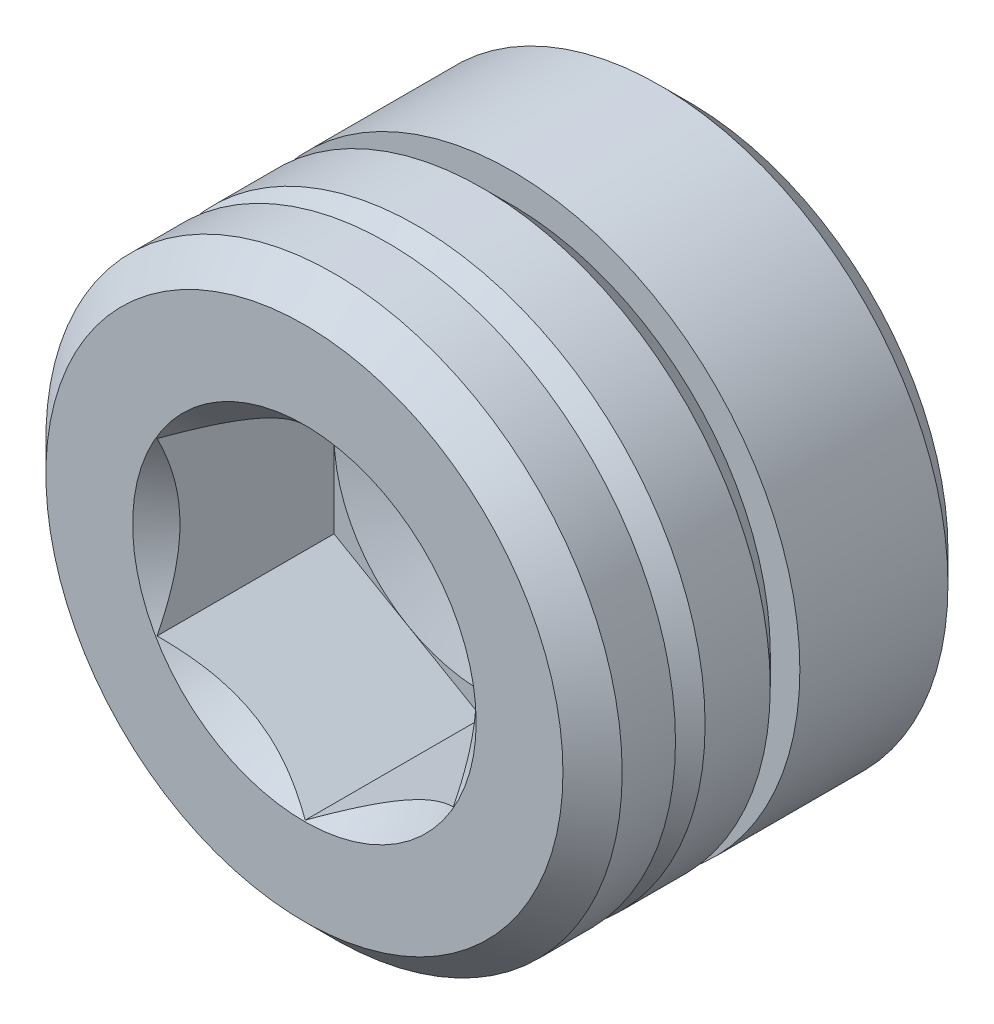
ISO-10303-21;
HEADER;
FILE_DESCRIPTION(('STEP AP214'),'2;1');
FILE_NAME('part.step','',(''),(''),'','','');
FILE_SCHEMA(('AUTOMOTIVE_DESIGN { 1 0 10303 214 1 1 1 1 }'));
ENDSEC;
DATA;
#1=APPLICATION_CONTEXT('core data for automotive mechanical design processes');
#2=APPLICATION_PROTOCOL_DEFINITION('international standard','automotive_design',2000,#1);
#3=PRODUCT_CONTEXT('',#1,'mechanical');
#4=PRODUCT('Part','Part','',(#3));
#5=PRODUCT_RELATED_PRODUCT_CATEGORY('part','',(#4));
#6=PRODUCT_DEFINITION_FORMATION('','',#4);
#7=PRODUCT_DEFINITION_CONTEXT('part definition',#1,'design');
#8=PRODUCT_DEFINITION('design','',#6,#7);
#9=PRODUCT_DEFINITION_SHAPE('','',#8);
#10=(LENGTH_UNIT() NAMED_UNIT(*) SI_UNIT(.MILLI.,.METRE.));
#11=(NAMED_UNIT(*) PLANE_ANGLE_UNIT() SI_UNIT($,.RADIAN.));
#12=(NAMED_UNIT(*) SI_UNIT($,.STERADIAN.) SOLID_ANGLE_UNIT());
#13=UNCERTAINTY_MEASURE_WITH_UNIT(LENGTH_MEASURE(1.E-05),#10,'distance_accuracy_value','');
#14=(GEOMETRIC_REPRESENTATION_CONTEXT(3) GLOBAL_UNCERTAINTY_ASSIGNED_CONTEXT((#13)) GLOBAL_UNIT_ASSIGNED_CONTEXT((#10,
#11,#12)) REPRESENTATION_CONTEXT('',''));
#15=CARTESIAN_POINT('',(0.,0.,0.));
#16=DIRECTION('',(0.,0.,1.));
#17=DIRECTION('',(1.,0.,0.));
#18=AXIS2_PLACEMENT_3D('',#15,#16,#17);
#19=CARTESIAN_POINT('',(0.,0.,-6.5));
#20=DIRECTION('',(0.,0.,1.));
#21=DIRECTION('',(1.,0.,0.));
#22=AXIS2_PLACEMENT_3D('',#19,#20,#21);
#23=CYLINDRICAL_SURFACE('',#22,4.865);
#24=CARTESIAN_POINT('',(0.,0.,-0.5));
#25=DIRECTION('',(0.,0.,1.));
#26=DIRECTION('',(1.,0.,0.));
#27=AXIS2_PLACEMENT_3D('',#24,#25,#26);
#28=CIRCLE('',#27,4.865);
#29=CARTESIAN_POINT('',(4.865,0.,-0.5));
#30=VERTEX_POINT('',#29);
#31=EDGE_CURVE('E40',#30,#30,#28,.T.);
#32=ORIENTED_EDGE('',*,*,#31,.F.);
#33=EDGE_LOOP('',(#32));
#34=FACE_BOUND('',#33,.T.);
#35=CARTESIAN_POINT('',(0.,0.,-1.4));
#36=DIRECTION('',(0.,0.,1.));
#37=DIRECTION('',(1.,0.,0.));
#38=AXIS2_PLACEMENT_3D('',#35,#36,#37);
#39=CIRCLE('',#38,4.865);
#40=CARTESIAN_POINT('',(4.865,0.,-1.4));
#41=VERTEX_POINT('',#40);
#42=EDGE_CURVE('E225',#41,#41,#39,.T.);
#43=ORIENTED_EDGE('',*,*,#42,.T.);
#44=EDGE_LOOP('',(#43));
#45=FACE_BOUND('',#44,.T.);
#46=ADVANCED_FACE('F32',(#34,#45),#23,.T.);
#47=CARTESIAN_POINT('',(0.,0.,0.));
#48=DIRECTION('',(0.,0.,-1.));
#49=DIRECTION('',(-1.,0.,0.));
#50=AXIS2_PLACEMENT_3D('',#47,#48,#49);
#51=PLANE('',#50);
#52=CARTESIAN_POINT('',(0.,0.,0.));
#53=DIRECTION('',(0.,0.,1.));
#54=DIRECTION('',(1.,0.,0.));
#55=AXIS2_PLACEMENT_3D('',#52,#53,#54);
#56=CIRCLE('',#55,2.9);
#57=CARTESIAN_POINT('',(2.9,0.,0.));
#58=VERTEX_POINT('',#57);
#59=EDGE_CURVE('E206',#58,#58,#56,.T.);
#60=ORIENTED_EDGE('',*,*,#59,.F.);
#61=EDGE_LOOP('',(#60));
#62=FACE_BOUND('',#61,.T.);
#63=CARTESIAN_POINT('',(0.,0.,0.));
#64=DIRECTION('',(0.,0.,1.));
#65=DIRECTION('',(1.,0.,0.));
#66=AXIS2_PLACEMENT_3D('',#63,#64,#65);
#67=CIRCLE('',#66,4.365);
#68=CARTESIAN_POINT('',(4.365,0.,0.));
#69=VERTEX_POINT('',#68);
#70=EDGE_CURVE('E11',#69,#69,#67,.T.);
#71=ORIENTED_EDGE('',*,*,#70,.T.);
#72=EDGE_LOOP('',(#71));
#73=FACE_BOUND('',#72,.T.);
#74=ADVANCED_FACE('F34',(#62,#73),#51,.F.);
#75=CARTESIAN_POINT('',(0.,0.,-0.5));
#76=DIRECTION('',(0.,0.,-1.));
#77=DIRECTION('',(-1.,0.,0.));
#78=AXIS2_PLACEMENT_3D('',#75,#76,#77);
#79=CONICAL_SURFACE('',#78,4.865,0.785398163397449);
#80=ORIENTED_EDGE('',*,*,#70,.F.);
#81=EDGE_LOOP('',(#80));
#82=FACE_BOUND('',#81,.T.);
#83=ORIENTED_EDGE('',*,*,#31,.T.);
#84=EDGE_LOOP('',(#83));
#85=FACE_BOUND('',#84,.T.);
#86=ADVANCED_FACE('F236',(#82,#85),#79,.T.);
#87=CARTESIAN_POINT('',(0.,4.865,-1.4));
#88=DIRECTION('',(0.,0.,-1.));
#89=DIRECTION('',(-1.,0.,0.));
#90=AXIS2_PLACEMENT_3D('',#87,#88,#89);
#91=PLANE('',#90);
#92=CARTESIAN_POINT('',(0.,0.,-1.4));
#93=DIRECTION('',(0.,0.,1.));
#94=DIRECTION('',(1.,0.,0.));
#95=AXIS2_PLACEMENT_3D('',#92,#93,#94);
#96=CIRCLE('',#95,4.365);
#97=CARTESIAN_POINT('',(4.365,0.,-1.4));
#98=VERTEX_POINT('',#97);
#99=EDGE_CURVE('E222',#98,#98,#96,.T.);
#100=ORIENTED_EDGE('',*,*,#99,.T.);
#101=EDGE_LOOP('',(#100));
#102=FACE_BOUND('',#101,.T.);
#103=ORIENTED_EDGE('',*,*,#42,.F.);
#104=EDGE_LOOP('',(#103));
#105=FACE_BOUND('',#104,.T.);
#106=ADVANCED_FACE('F245',(#102,#105),#91,.T.);
#107=CARTESIAN_POINT('',(0.,0.,-1.4));
#108=DIRECTION('',(0.,0.,-1.));
#109=DIRECTION('',(-1.,0.,0.));
#110=AXIS2_PLACEMENT_3D('',#107,#108,#109);
#111=CONICAL_SURFACE('',#110,4.365,0.785398163397449);
#112=CARTESIAN_POINT('',(0.,0.,-1.9));
#113=DIRECTION('',(0.,0.,1.));
#114=DIRECTION('',(1.,0.,0.));
#115=AXIS2_PLACEMENT_3D('',#112,#113,#114);
#116=CIRCLE('',#115,4.865);
#117=CARTESIAN_POINT('',(4.865,0.,-1.9));
#118=VERTEX_POINT('',#117);
#119=EDGE_CURVE('E219',#118,#118,#116,.T.);
#120=ORIENTED_EDGE('',*,*,#119,.T.);
#121=EDGE_LOOP('',(#120));
#122=FACE_BOUND('',#121,.T.);
#123=ORIENTED_EDGE('',*,*,#99,.F.);
#124=EDGE_LOOP('',(#123));
#125=FACE_BOUND('',#124,.T.);
#126=ADVANCED_FACE('F247',(#122,#125),#111,.T.);
#127=CARTESIAN_POINT('',(0.,0.,-3.));
#128=DIRECTION('',(0.,0.,1.));
#129=DIRECTION('',(1.,0.,0.));
#130=AXIS2_PLACEMENT_3D('',#127,#128,#129);
#131=CIRCLE('',#130,4.865);
#132=CARTESIAN_POINT('',(4.865,0.,-3.));
#133=VERTEX_POINT('',#132);
#134=EDGE_CURVE('E216',#133,#133,#131,.T.);
#135=ORIENTED_EDGE('',*,*,#134,.T.);
#136=EDGE_LOOP('',(#135));
#137=FACE_BOUND('',#136,.T.);
#138=ORIENTED_EDGE('',*,*,#119,.F.);
#139=EDGE_LOOP('',(#138));
#140=FACE_BOUND('',#139,.T.);
#141=ADVANCED_FACE('F241',(#137,#140),#23,.T.);
#142=CARTESIAN_POINT('',(0.,4.365,-3.5));
#143=DIRECTION('',(0.,0.,1.));
#144=DIRECTION('',(1.,0.,0.));
#145=AXIS2_PLACEMENT_3D('',#142,#143,#144);
#146=PLANE('',#145);
#147=CARTESIAN_POINT('',(0.,0.,-3.5));
#148=DIRECTION('',(0.,0.,1.));
#149=DIRECTION('',(1.,0.,0.));
#150=AXIS2_PLACEMENT_3D('',#147,#148,#149);
#151=CIRCLE('',#150,4.865);
#152=CARTESIAN_POINT('',(4.865,0.,-3.5));
#153=VERTEX_POINT('',#152);
#154=EDGE_CURVE('E210',#153,#153,#151,.T.);
#155=ORIENTED_EDGE('',*,*,#154,.T.);
#156=EDGE_LOOP('',(#155));
#157=FACE_BOUND('',#156,.T.);
#158=CARTESIAN_POINT('',(0.,0.,-3.5));
#159=DIRECTION('',(0.,0.,1.));
#160=DIRECTION('',(1.,0.,0.));
#161=AXIS2_PLACEMENT_3D('',#158,#159,#160);
#162=CIRCLE('',#161,4.365);
#163=CARTESIAN_POINT('',(4.365,0.,-3.5));
#164=VERTEX_POINT('',#163);
#165=EDGE_CURVE('E213',#164,#164,#162,.T.);
#166=ORIENTED_EDGE('',*,*,#165,.F.);
#167=EDGE_LOOP('',(#166));
#168=FACE_BOUND('',#167,.T.);
#169=ADVANCED_FACE('F277',(#157,#168),#146,.T.);
#170=CARTESIAN_POINT('',(0.,0.,-3.));
#171=DIRECTION('',(0.,0.,1.));
#172=DIRECTION('',(1.,0.,0.));
#173=AXIS2_PLACEMENT_3D('',#170,#171,#172);
#174=CONICAL_SURFACE('',#173,4.865,0.785398163397449);
#175=ORIENTED_EDGE('',*,*,#165,.T.);
#176=EDGE_LOOP('',(#175));
#177=FACE_BOUND('',#176,.T.);
#178=ORIENTED_EDGE('',*,*,#134,.F.);
#179=EDGE_LOOP('',(#178));
#180=FACE_BOUND('',#179,.T.);
#181=ADVANCED_FACE('F263',(#177,#180),#174,.T.);
#182=CARTESIAN_POINT('',(0.,4.365,-6.5));
#183=DIRECTION('',(0.,0.,1.));
#184=DIRECTION('',(1.,0.,0.));
#185=AXIS2_PLACEMENT_3D('',#182,#183,#184);
#186=PLANE('',#185);
#187=CARTESIAN_POINT('',(0.,0.,-6.5));
#188=DIRECTION('',(0.,0.,1.));
#189=DIRECTION('',(1.,0.,0.));
#190=AXIS2_PLACEMENT_3D('',#187,#188,#189);
#191=CIRCLE('',#190,4.365);
#192=CARTESIAN_POINT('',(4.365,0.,-6.5));
#193=VERTEX_POINT('',#192);
#194=EDGE_CURVE('E228',#193,#193,#191,.T.);
#195=ORIENTED_EDGE('',*,*,#194,.F.);
#196=EDGE_LOOP('',(#195));
#197=FACE_BOUND('',#196,.T.);
#198=ADVANCED_FACE('F259',(#197),#186,.F.);
#199=CARTESIAN_POINT('',(0.,0.,-6.5));
#200=DIRECTION('',(0.,0.,1.));
#201=DIRECTION('',(1.,0.,0.));
#202=AXIS2_PLACEMENT_3D('',#199,#200,#201);
#203=CONICAL_SURFACE('',#202,4.365,0.785398163397449);
#204=CARTESIAN_POINT('',(0.,0.,-6.));
#205=DIRECTION('',(0.,0.,1.));
#206=DIRECTION('',(1.,0.,0.));
#207=AXIS2_PLACEMENT_3D('',#204,#205,#206);
#208=CIRCLE('',#207,4.865);
#209=CARTESIAN_POINT('',(4.865,0.,-6.));
#210=VERTEX_POINT('',#209);
#211=EDGE_CURVE('E231',#210,#210,#208,.T.);
#212=ORIENTED_EDGE('',*,*,#211,.F.);
#213=EDGE_LOOP('',(#212));
#214=FACE_BOUND('',#213,.T.);
#215=ORIENTED_EDGE('',*,*,#194,.T.);
#216=EDGE_LOOP('',(#215));
#217=FACE_BOUND('',#216,.T.);
#218=ADVANCED_FACE('F262',(#214,#217),#203,.T.);
#219=ORIENTED_EDGE('',*,*,#211,.T.);
#220=EDGE_LOOP('',(#219));
#221=FACE_BOUND('',#220,.T.);
#222=ORIENTED_EDGE('',*,*,#154,.F.);
#223=EDGE_LOOP('',(#222));
#224=FACE_BOUND('',#223,.T.);
#225=ADVANCED_FACE('F242',(#221,#224),#23,.T.);
#226=CARTESIAN_POINT('',(0.,0.,-0.4));
#227=DIRECTION('',(0.,0.,1.));
#228=DIRECTION('',(1.,0.,0.));
#229=AXIS2_PLACEMENT_3D('',#226,#227,#228);
#230=CONICAL_SURFACE('',#229,2.5,0.785398163397448);
#231=CARTESIAN_POINT('',(2.5002,1.44326020292026,-0.0131331770700893));
#232=CARTESIAN_POINT('',(2.41426172221223,1.49287669073472,-0.062707948697128));
#233=CARTESIAN_POINT('',(2.32688643272424,1.54332283764113,-0.109371172689351));
#234=CARTESIAN_POINT('',(2.1487185438344,1.64618811625262,-0.194810514013558));
#235=CARTESIAN_POINT('',(2.05790899931891,1.69861703122362,-0.233539091645859));
#236=CARTESIAN_POINT('',(1.87479587687306,1.80433744175988,-0.299881950154125));
#237=CARTESIAN_POINT('',(1.78253893547064,1.85760201171318,-0.327662985521009));
#238=CARTESIAN_POINT('',(1.59599399122369,1.96530378549012,-0.370465478141201));
#239=CARTESIAN_POINT('',(1.50171168743369,2.01973769896309,-0.385518887380524));
#240=CARTESIAN_POINT('',(1.33922174170812,2.11355131286835,-0.399100931842387));
#241=CARTESIAN_POINT('',(1.27122403211982,2.15280980880343,-0.401111554811067));
#242=CARTESIAN_POINT('',(1.13533975883075,2.23126263056551,-0.397724536864381));
#243=CARTESIAN_POINT('',(1.06745324244773,2.27045692907359,-0.39232429875205));
#244=CARTESIAN_POINT('',(0.932321211763861,2.34847544336506,-0.374422865649399));
#245=CARTESIAN_POINT('',(0.865076500246406,2.38729919566124,-0.36191372700539));
#246=CARTESIAN_POINT('',(0.731749899181766,2.46427534467604,-0.330481152096164));
#247=CARTESIAN_POINT('',(0.665667920900308,2.50242779262543,-0.311558207555053));
#248=CARTESIAN_POINT('',(0.496403653308706,2.60015256308362,-0.255381292643628));
#249=CARTESIAN_POINT('',(0.394270877777084,2.65911894852988,-0.213892822455692));
#250=CARTESIAN_POINT('',(0.244093585059477,2.74582384890656,-0.143854607328799));
#251=CARTESIAN_POINT('',(0.19460346011738,2.7743969858641,-0.119246401935815));
#252=CARTESIAN_POINT('',(0.0965399361611477,2.83101398781791,-0.0677867673366589));
#253=CARTESIAN_POINT('',(0.0479659965030693,2.85905816495511,-0.0409367152725411));
#254=CARTESIAN_POINT('',(-0.000200000000000214,2.88686681600194,-0.0131331770701356));
#255=B_SPLINE_CURVE_WITH_KNOTS('',3,(#231,#232,#233,#234,#235,#236,#237,#238,#239,#240,#241,
#242,#243,#244,#245,#246,#247,#248,#249,#250,#251,#252,#253,#254),.UNSPECIFIED.,.F.,.F.,(4,2,2,
2,2,2,2,2,2,2,2,4),(0.,0.33301208513393,0.667964518301409,0.997597032043317,1.32639954393847,
1.56169424147171,1.79707142102085,2.03271213522173,2.26833478775653,2.64260240809532,
2.82922877818862,3.01574133749021),.UNSPECIFIED.);
#256=CARTESIAN_POINT('',(2.5,1.4433756729741,-0.0132486540518531));
#257=VERTEX_POINT('',#256);
#258=CARTESIAN_POINT('',(0.,2.8867513459481,-0.0132486540519));
#259=VERTEX_POINT('',#258);
#260=EDGE_CURVE('E476',#257,#259,#255,.T.);
#261=ORIENTED_EDGE('',*,*,#260,.F.);
#262=CARTESIAN_POINT('',(2.5,-3.01755698672711,1.01862860809054));
#263=CARTESIAN_POINT('',(2.5,-2.94467480099732,0.962517959419891));
#264=CARTESIAN_POINT('',(2.5,-2.87140052127294,0.906908610297385));
#265=CARTESIAN_POINT('',(2.5,-2.72390729450025,0.796921713998471));
#266=CARTESIAN_POINT('',(2.5,-2.64968812856028,0.742544460667749));
#267=CARTESIAN_POINT('',(2.5,-2.49960234133529,0.63486400368164));
#268=CARTESIAN_POINT('',(2.5,-2.42372742857518,0.581572319008927));
#269=CARTESIAN_POINT('',(2.5,-2.27071587266825,0.476838423141059));
#270=CARTESIAN_POINT('',(2.5,-2.19357931685321,0.4253960847146));
#271=CARTESIAN_POINT('',(2.5,-2.03286176497117,0.321571878570448));
#272=CARTESIAN_POINT('',(2.5,-1.94918366204473,0.269339575524413));
#273=CARTESIAN_POINT('',(2.5,-1.77988701750962,0.168125304722888));
#274=CARTESIAN_POINT('',(2.5,-1.69426873048053,0.119142913808118));
#275=CARTESIAN_POINT('',(2.5,-1.52103010729432,0.0254467757476879));
#276=CARTESIAN_POINT('',(2.5,-1.43341627759486,-0.0192789073600382));
#277=CARTESIAN_POINT('',(2.5,-1.25570853877067,-0.103451302113907));
#278=CARTESIAN_POINT('',(2.5,-1.1656158258591,-0.142900507927059));
#279=CARTESIAN_POINT('',(2.5,-0.99183653622791,-0.211502196122745));
#280=CARTESIAN_POINT('',(2.5,-0.908402638106546,-0.241288250931242));
#281=CARTESIAN_POINT('',(2.5,-0.739404629668206,-0.294182445662333));
#282=CARTESIAN_POINT('',(2.5,-0.653840384437043,-0.317290161473531));
#283=CARTESIAN_POINT('',(2.5,-0.482585667546743,-0.355189850304741));
#284=CARTESIAN_POINT('',(2.5,-0.396929270953566,-0.370133204510761));
#285=CARTESIAN_POINT('',(2.5,-0.224546473226209,-0.391391619790405));
#286=CARTESIAN_POINT('',(2.5,-0.137820299541683,-0.39770848412608));
#287=CARTESIAN_POINT('',(2.5,0.0319957557755689,-0.401173193038338));
#288=CARTESIAN_POINT('',(2.5,0.115077718195651,-0.398712275622634));
#289=CARTESIAN_POINT('',(2.5,0.28059510652013,-0.385656459671616));
#290=CARTESIAN_POINT('',(2.5,0.363030473192649,-0.375060824541121));
#291=CARTESIAN_POINT('',(2.5,0.52805817999491,-0.346156195749019));
#292=CARTESIAN_POINT('',(2.5,0.610626262505323,-0.327710822763318));
#293=CARTESIAN_POINT('',(2.5,0.773934722664069,-0.28412870193578));
#294=CARTESIAN_POINT('',(2.5,0.854675201821975,-0.258992326723009));
#295=CARTESIAN_POINT('',(2.5,1.10294141795223,-0.172090068047425));
#296=CARTESIAN_POINT('',(2.5,1.2671021925792,-0.100680848920713));
#297=CARTESIAN_POINT('',(2.5,1.50736283278926,0.0184433132476623));
#298=CARTESIAN_POINT('',(2.5,1.58660007042279,0.06024544768032));
#299=CARTESIAN_POINT('',(2.5,1.74328132600688,0.147092574739829));
#300=CARTESIAN_POINT('',(2.5,1.82072565590588,0.19213699755));
#301=CARTESIAN_POINT('',(2.5,1.97024569361975,0.282530677171682));
#302=CARTESIAN_POINT('',(2.5,2.04239770835829,0.327755136218187));
#303=CARTESIAN_POINT('',(2.5,2.18546367646082,0.420130926378547));
#304=CARTESIAN_POINT('',(2.5,2.25637753646808,0.467282401901416));
#305=CARTESIAN_POINT('',(2.5,2.39655741321448,0.562783743747668));
#306=CARTESIAN_POINT('',(2.5,2.46583208730654,0.611120955220319));
#307=CARTESIAN_POINT('',(2.5,2.60343097037792,0.709091677176423));
#308=CARTESIAN_POINT('',(2.5,2.67175543611524,0.758724826624572));
#309=CARTESIAN_POINT('',(2.5,2.73968148121383,0.808888596130387));
#310=B_SPLINE_CURVE_WITH_KNOTS('',3,(#262,#263,#264,#265,#266,#267,#268,#269,#270,#271,#272,
#273,#274,#275,#276,#277,#278,#279,#280,#281,#282,#283,#284,#285,#286,#287,#288,#289,#290,#291,
#292,#293,#294,#295,#296,#297,#298,#299,#300,#301,#302,#303,#304,#305,#306,#307,#308,#309),
.UNSPECIFIED.,.F.,.F.,(4,2,2,2,2,2,2,2,2,2,2,2,2,2,2,2,2,2,2,2,2,2,2,4),(0.,0.275943374942262,
0.551951881998573,0.830089230356277,1.10820740666027,1.40407514318273,1.69990427992987,
1.99487782562456,2.28971144213853,2.55525654288693,2.82081850351157,3.08127318840113,
3.34167342009059,3.59061511682889,3.83957935778947,4.09305796199127,4.34652245265104,
4.88192415754218,5.15066436530966,5.41935745804677,5.67478760557292,5.93023693004823,
6.18363611951778,6.43696545228341),.UNSPECIFIED.);
#311=CARTESIAN_POINT('',(2.5,-1.4433756729741,-0.0132486540518531));
#312=VERTEX_POINT('',#311);
#313=EDGE_CURVE('E481',#312,#257,#310,.T.);
#314=ORIENTED_EDGE('',*,*,#313,.F.);
#315=CARTESIAN_POINT('',(-0.000200000000000038,-2.88686681600194,-0.0131331770701359));
#316=CARTESIAN_POINT('',(0.0857382777877621,-2.83725032818748,-0.0627079486971693));
#317=CARTESIAN_POINT('',(0.173113567275748,-2.78680418128108,-0.109371172689387));
#318=CARTESIAN_POINT('',(0.351281456165578,-2.68393890266959,-0.194810514013586));
#319=CARTESIAN_POINT('',(0.442091000681061,-2.63150998769859,-0.233539091645882));
#320=CARTESIAN_POINT('',(0.625204123126901,-2.52578957716234,-0.29988195015414));
#321=CARTESIAN_POINT('',(0.717461064529317,-2.47252500720904,-0.327662985521019));
#322=CARTESIAN_POINT('',(0.904006008776257,-2.36482323343211,-0.370465478141206));
#323=CARTESIAN_POINT('',(0.998288312566251,-2.31038931995914,-0.385518887380527));
#324=CARTESIAN_POINT('',(1.16077825829181,-2.21657570605389,-0.399100931842388));
#325=CARTESIAN_POINT('',(1.22877596788012,-2.1773172101188,-0.401111554811067));
#326=CARTESIAN_POINT('',(1.36466024116918,-2.09886438835673,-0.39772453686438));
#327=CARTESIAN_POINT('',(1.4325467575522,-2.05967008984865,-0.392324298752048));
#328=CARTESIAN_POINT('',(1.56767878823607,-1.98165157555718,-0.374422865649397));
#329=CARTESIAN_POINT('',(1.63492349975353,-1.942827823261,-0.361913727005388));
#330=CARTESIAN_POINT('',(1.76825010081817,-1.86585167424619,-0.330481152096161));
#331=CARTESIAN_POINT('',(1.83433207909962,-1.82769922629681,-0.31155820755505));
#332=CARTESIAN_POINT('',(2.00359634669124,-1.72997445583861,-0.25538129264362));
#333=CARTESIAN_POINT('',(2.10572912222287,-1.67100807039235,-0.213892822455677));
#334=CARTESIAN_POINT('',(2.2559064149405,-1.58430317001566,-0.143854607328772));
#335=CARTESIAN_POINT('',(2.3053965398826,-1.55573003305811,-0.119246401935785));
#336=CARTESIAN_POINT('',(2.40346006383884,-1.49911303110429,-0.0677867673366203));
#337=CARTESIAN_POINT('',(2.45203400349693,-1.4710688539671,-0.0409367152724984));
#338=CARTESIAN_POINT('',(2.5002,-1.44326020292026,-0.0131331770700891));
#339=B_SPLINE_CURVE_WITH_KNOTS('',3,(#315,#316,#317,#318,#319,#320,#321,#322,#323,#324,#325,
#326,#327,#328,#329,#330,#331,#332,#333,#334,#335,#336,#337,#338),.UNSPECIFIED.,.F.,.F.,(4,2,2,
2,2,2,2,2,2,2,2,4),(0.,0.333012085133908,0.667964518301366,0.997597032043252,1.32639954393838,
1.56169424147162,1.79707142102076,2.03271213522164,2.26833478775644,2.64260240809528,
2.82922877818859,3.01574133749021),.UNSPECIFIED.);
#340=CARTESIAN_POINT('',(0.,-2.8867513459481,-0.0132486540519));
#341=VERTEX_POINT('',#340);
#342=EDGE_CURVE('E166',#341,#312,#339,.T.);
#343=ORIENTED_EDGE('',*,*,#342,.F.);
#344=CARTESIAN_POINT('',(-2.5002,-1.44326020292026,-0.0131331770700893));
#345=CARTESIAN_POINT('',(-2.41426172221223,-1.49287669073472,-0.062707948697128));
#346=CARTESIAN_POINT('',(-2.32688643272424,-1.54332283764113,-0.109371172689351));
#347=CARTESIAN_POINT('',(-2.1487185438344,-1.64618811625262,-0.194810514013558));
#348=CARTESIAN_POINT('',(-2.05790899931891,-1.69861703122362,-0.233539091645859));
#349=CARTESIAN_POINT('',(-1.87479587687306,-1.80433744175988,-0.299881950154125));
#350=CARTESIAN_POINT('',(-1.78253893547064,-1.85760201171318,-0.327662985521009));
#351=CARTESIAN_POINT('',(-1.59599399122369,-1.96530378549012,-0.370465478141201));
#352=CARTESIAN_POINT('',(-1.50171168743369,-2.01973769896309,-0.385518887380524));
#353=CARTESIAN_POINT('',(-1.33922174170812,-2.11355131286835,-0.399100931842387));
#354=CARTESIAN_POINT('',(-1.27122403211982,-2.15280980880343,-0.401111554811067));
#355=CARTESIAN_POINT('',(-1.13533975883075,-2.23126263056551,-0.397724536864381));
#356=CARTESIAN_POINT('',(-1.06745324244773,-2.27045692907359,-0.39232429875205));
#357=CARTESIAN_POINT('',(-0.932321211763861,-2.34847544336506,-0.374422865649399));
#358=CARTESIAN_POINT('',(-0.865076500246406,-2.38729919566124,-0.36191372700539));
#359=CARTESIAN_POINT('',(-0.731749899181766,-2.46427534467604,-0.330481152096164));
#360=CARTESIAN_POINT('',(-0.665667920900308,-2.50242779262543,-0.311558207555053));
#361=CARTESIAN_POINT('',(-0.496403653308706,-2.60015256308362,-0.255381292643628));
#362=CARTESIAN_POINT('',(-0.394270877777084,-2.65911894852988,-0.213892822455692));
#363=CARTESIAN_POINT('',(-0.244093585059477,-2.74582384890656,-0.143854607328799));
#364=CARTESIAN_POINT('',(-0.19460346011738,-2.7743969858641,-0.119246401935815));
#365=CARTESIAN_POINT('',(-0.0965399361611477,-2.83101398781791,-0.0677867673366589));
#366=CARTESIAN_POINT('',(-0.0479659965030693,-2.85905816495511,-0.0409367152725411));
#367=CARTESIAN_POINT('',(0.000200000000000214,-2.88686681600194,-0.0131331770701356));
#368=B_SPLINE_CURVE_WITH_KNOTS('',3,(#344,#345,#346,#347,#348,#349,#350,#351,#352,#353,#354,
#355,#356,#357,#358,#359,#360,#361,#362,#363,#364,#365,#366,#367),.UNSPECIFIED.,.F.,.F.,(4,2,2,
2,2,2,2,2,2,2,2,4),(0.,0.33301208513393,0.667964518301409,0.997597032043317,1.32639954393847,
1.56169424147171,1.79707142102085,2.03271213522173,2.26833478775653,2.64260240809532,
2.82922877818862,3.01574133749021),.UNSPECIFIED.);
#369=CARTESIAN_POINT('',(-2.5,-1.4433756729741,-0.0132486540518531));
#370=VERTEX_POINT('',#369);
#371=EDGE_CURVE('E147',#370,#341,#368,.T.);
#372=ORIENTED_EDGE('',*,*,#371,.F.);
#373=CARTESIAN_POINT('',(-2.5,-3.01755698672711,1.01862860809054));
#374=CARTESIAN_POINT('',(-2.5,-2.94467480099732,0.962517959419891));
#375=CARTESIAN_POINT('',(-2.5,-2.87140052127294,0.906908610297385));
#376=CARTESIAN_POINT('',(-2.5,-2.72390729450025,0.796921713998471));
#377=CARTESIAN_POINT('',(-2.5,-2.64968812856028,0.742544460667749));
#378=CARTESIAN_POINT('',(-2.5,-2.49960234133529,0.63486400368164));
#379=CARTESIAN_POINT('',(-2.5,-2.42372742857518,0.581572319008927));
#380=CARTESIAN_POINT('',(-2.5,-2.27071587266825,0.476838423141059));
#381=CARTESIAN_POINT('',(-2.5,-2.19357931685321,0.4253960847146));
#382=CARTESIAN_POINT('',(-2.5,-2.03286176497117,0.321571878570448));
#383=CARTESIAN_POINT('',(-2.5,-1.94918366204473,0.269339575524413));
#384=CARTESIAN_POINT('',(-2.5,-1.77988701750962,0.168125304722888));
#385=CARTESIAN_POINT('',(-2.5,-1.69426873048053,0.119142913808118));
#386=CARTESIAN_POINT('',(-2.5,-1.52103010729432,0.0254467757476879));
#387=CARTESIAN_POINT('',(-2.5,-1.43341627759486,-0.0192789073600382));
#388=CARTESIAN_POINT('',(-2.5,-1.25570853877067,-0.103451302113907));
#389=CARTESIAN_POINT('',(-2.5,-1.1656158258591,-0.142900507927059));
#390=CARTESIAN_POINT('',(-2.5,-0.99183653622791,-0.211502196122745));
#391=CARTESIAN_POINT('',(-2.5,-0.908402638106546,-0.241288250931242));
#392=CARTESIAN_POINT('',(-2.5,-0.739404629668206,-0.294182445662333));
#393=CARTESIAN_POINT('',(-2.5,-0.653840384437043,-0.317290161473531));
#394=CARTESIAN_POINT('',(-2.5,-0.482585667546743,-0.355189850304741));
#395=CARTESIAN_POINT('',(-2.5,-0.396929270953566,-0.370133204510761));
#396=CARTESIAN_POINT('',(-2.5,-0.224546473226209,-0.391391619790405));
#397=CARTESIAN_POINT('',(-2.5,-0.137820299541683,-0.39770848412608));
#398=CARTESIAN_POINT('',(-2.5,0.0319957557755689,-0.401173193038338));
#399=CARTESIAN_POINT('',(-2.5,0.115077718195651,-0.398712275622634));
#400=CARTESIAN_POINT('',(-2.5,0.28059510652013,-0.385656459671616));
#401=CARTESIAN_POINT('',(-2.5,0.363030473192649,-0.375060824541121));
#402=CARTESIAN_POINT('',(-2.5,0.52805817999491,-0.346156195749019));
#403=CARTESIAN_POINT('',(-2.5,0.610626262505323,-0.327710822763318));
#404=CARTESIAN_POINT('',(-2.5,0.773934722664069,-0.28412870193578));
#405=CARTESIAN_POINT('',(-2.5,0.854675201821975,-0.258992326723009));
#406=CARTESIAN_POINT('',(-2.5,1.10294141795223,-0.172090068047425));
#407=CARTESIAN_POINT('',(-2.5,1.2671021925792,-0.100680848920713));
#408=CARTESIAN_POINT('',(-2.5,1.50736283278926,0.0184433132476623));
#409=CARTESIAN_POINT('',(-2.5,1.58660007042279,0.06024544768032));
#410=CARTESIAN_POINT('',(-2.5,1.74328132600688,0.147092574739829));
#411=CARTESIAN_POINT('',(-2.5,1.82072565590588,0.19213699755));
#412=CARTESIAN_POINT('',(-2.5,1.97024569361975,0.282530677171682));
#413=CARTESIAN_POINT('',(-2.5,2.04239770835829,0.327755136218187));
#414=CARTESIAN_POINT('',(-2.5,2.18546367646082,0.420130926378547));
#415=CARTESIAN_POINT('',(-2.5,2.25637753646808,0.467282401901416));
#416=CARTESIAN_POINT('',(-2.5,2.39655741321448,0.562783743747668));
#417=CARTESIAN_POINT('',(-2.5,2.46583208730654,0.611120955220319));
#418=CARTESIAN_POINT('',(-2.5,2.60343097037792,0.709091677176423));
#419=CARTESIAN_POINT('',(-2.5,2.67175543611524,0.758724826624572));
#420=CARTESIAN_POINT('',(-2.5,2.73968148121383,0.808888596130387));
#421=B_SPLINE_CURVE_WITH_KNOTS('',3,(#373,#374,#375,#376,#377,#378,#379,#380,#381,#382,#383,
#384,#385,#386,#387,#388,#389,#390,#391,#392,#393,#394,#395,#396,#397,#398,#399,#400,#401,#402,
#403,#404,#405,#406,#407,#408,#409,#410,#411,#412,#413,#414,#415,#416,#417,#418,#419,#420),
.UNSPECIFIED.,.F.,.F.,(4,2,2,2,2,2,2,2,2,2,2,2,2,2,2,2,2,2,2,2,2,2,2,4),(0.,0.275943374942262,
0.551951881998573,0.830089230356277,1.10820740666027,1.40407514318273,1.69990427992987,
1.99487782562456,2.28971144213853,2.55525654288693,2.82081850351157,3.08127318840113,
3.34167342009059,3.59061511682889,3.83957935778947,4.09305796199127,4.34652245265104,
4.88192415754218,5.15066436530966,5.41935745804677,5.67478760557292,5.93023693004823,
6.18363611951778,6.43696545228341),.UNSPECIFIED.);
#422=CARTESIAN_POINT('',(-2.5,1.4433756729741,-0.0132486540518531));
#423=VERTEX_POINT('',#422);
#424=EDGE_CURVE('E120',#423,#370,#421,.F.);
#425=ORIENTED_EDGE('',*,*,#424,.F.);
#426=CARTESIAN_POINT('',(0.000200000000000038,2.88686681600194,-0.0131331770701359));
#427=CARTESIAN_POINT('',(-0.0857382777877621,2.83725032818748,-0.0627079486971693));
#428=CARTESIAN_POINT('',(-0.173113567275748,2.78680418128108,-0.109371172689387));
#429=CARTESIAN_POINT('',(-0.351281456165578,2.68393890266959,-0.194810514013586));
#430=CARTESIAN_POINT('',(-0.442091000681061,2.63150998769859,-0.233539091645882));
#431=CARTESIAN_POINT('',(-0.625204123126901,2.52578957716234,-0.29988195015414));
#432=CARTESIAN_POINT('',(-0.717461064529317,2.47252500720904,-0.327662985521019));
#433=CARTESIAN_POINT('',(-0.904006008776257,2.36482323343211,-0.370465478141206));
#434=CARTESIAN_POINT('',(-0.998288312566251,2.31038931995914,-0.385518887380527));
#435=CARTESIAN_POINT('',(-1.16077825829181,2.21657570605389,-0.399100931842388));
#436=CARTESIAN_POINT('',(-1.22877596788012,2.1773172101188,-0.401111554811067));
#437=CARTESIAN_POINT('',(-1.36466024116918,2.09886438835673,-0.39772453686438));
#438=CARTESIAN_POINT('',(-1.4325467575522,2.05967008984865,-0.392324298752048));
#439=CARTESIAN_POINT('',(-1.56767878823607,1.98165157555718,-0.374422865649397));
#440=CARTESIAN_POINT('',(-1.63492349975353,1.942827823261,-0.361913727005388));
#441=CARTESIAN_POINT('',(-1.76825010081817,1.86585167424619,-0.330481152096161));
#442=CARTESIAN_POINT('',(-1.83433207909962,1.82769922629681,-0.31155820755505));
#443=CARTESIAN_POINT('',(-2.00359634669124,1.72997445583861,-0.25538129264362));
#444=CARTESIAN_POINT('',(-2.10572912222287,1.67100807039235,-0.213892822455677));
#445=CARTESIAN_POINT('',(-2.2559064149405,1.58430317001566,-0.143854607328772));
#446=CARTESIAN_POINT('',(-2.3053965398826,1.55573003305811,-0.119246401935785));
#447=CARTESIAN_POINT('',(-2.40346006383884,1.49911303110429,-0.0677867673366203));
#448=CARTESIAN_POINT('',(-2.45203400349693,1.4710688539671,-0.0409367152724984));
#449=CARTESIAN_POINT('',(-2.5002,1.44326020292026,-0.0131331770700891));
#450=B_SPLINE_CURVE_WITH_KNOTS('',3,(#426,#427,#428,#429,#430,#431,#432,#433,#434,#435,#436,
#437,#438,#439,#440,#441,#442,#443,#444,#445,#446,#447,#448,#449),.UNSPECIFIED.,.F.,.F.,(4,2,2,
2,2,2,2,2,2,2,2,4),(0.,0.333012085133908,0.667964518301366,0.997597032043252,1.32639954393838,
1.56169424147162,1.79707142102076,2.03271213522164,2.26833478775644,2.64260240809528,
2.82922877818859,3.01574133749021),.UNSPECIFIED.);
#451=EDGE_CURVE('E196',#259,#423,#450,.T.);
#452=ORIENTED_EDGE('',*,*,#451,.F.);
#453=EDGE_LOOP('',(#261,#314,#343,#372,#425,#452));
#454=FACE_BOUND('',#453,.T.);
#455=ORIENTED_EDGE('',*,*,#59,.T.);
#456=EDGE_LOOP('',(#455));
#457=FACE_BOUND('',#456,.T.);
#458=ADVANCED_FACE('F173',(#454,#457),#230,.F.);
#459=CARTESIAN_POINT('',(-2.5,1.4433756729741,-3.));
#460=DIRECTION('',(-1.,0.,0.));
#461=DIRECTION('',(0.,0.,1.));
#462=AXIS2_PLACEMENT_3D('',#459,#460,#461);
#463=PLANE('',#462);
#464=ORIENTED_EDGE('',*,*,#424,.T.);
#465=DIRECTION('',(0.,0.,1.));
#466=VECTOR('',#465,1.);
#467=CARTESIAN_POINT('',(-2.5,-1.4433756729741,-3.));
#468=LINE('',#467,#466);
#469=CARTESIAN_POINT('',(-2.5,-1.4433756729741,-3.));
#470=VERTEX_POINT('',#469);
#471=EDGE_CURVE('E116',#470,#370,#468,.T.);
#472=ORIENTED_EDGE('',*,*,#471,.F.);
#473=DIRECTION('',(0.,-1.,0.));
#474=VECTOR('',#473,1.);
#475=CARTESIAN_POINT('',(-2.5,1.4433756729741,-3.));
#476=LINE('',#475,#474);
#477=CARTESIAN_POINT('',(-2.5,0.,-3.));
#478=VERTEX_POINT('',#477);
#479=EDGE_CURVE('E103',#478,#470,#476,.T.);
#480=ORIENTED_EDGE('',*,*,#479,.F.);
#481=CARTESIAN_POINT('',(-2.5,1.4433756729741,-3.));
#482=VERTEX_POINT('',#481);
#483=EDGE_CURVE('E113',#482,#478,#476,.T.);
#484=ORIENTED_EDGE('',*,*,#483,.F.);
#485=DIRECTION('',(0.,0.,1.));
#486=VECTOR('',#485,1.);
#487=CARTESIAN_POINT('',(-2.5,1.4433756729741,-3.));
#488=LINE('',#487,#486);
#489=EDGE_CURVE('E145',#482,#423,#488,.T.);
#490=ORIENTED_EDGE('',*,*,#489,.T.);
#491=EDGE_LOOP('',(#464,#472,#480,#484,#490));
#492=FACE_BOUND('',#491,.T.);
#493=ADVANCED_FACE('F117',(#492),#463,.F.);
#494=CARTESIAN_POINT('',(0.,2.8867513459481,-3.));
#495=DIRECTION('',(-0.499999999999983,0.866025403784448,0.));
#496=DIRECTION('',(-0.866025403784448,-0.499999999999983,0.));
#497=AXIS2_PLACEMENT_3D('',#494,#495,#496);
#498=PLANE('',#497);
#499=ORIENTED_EDGE('',*,*,#451,.T.);
#500=ORIENTED_EDGE('',*,*,#489,.F.);
#501=DIRECTION('',(-0.866025403784448,-0.499999999999983,0.));
#502=VECTOR('',#501,1.);
#503=CARTESIAN_POINT('',(0.,2.8867513459481,-3.));
#504=LINE('',#503,#502);
#505=CARTESIAN_POINT('',(-1.24999999999996,2.16506350946112,-3.));
#506=VERTEX_POINT('',#505);
#507=EDGE_CURVE('E142',#506,#482,#504,.T.);
#508=ORIENTED_EDGE('',*,*,#507,.F.);
#509=CARTESIAN_POINT('',(0.,2.8867513459481,-3.));
#510=VERTEX_POINT('',#509);
#511=EDGE_CURVE('E124',#510,#506,#504,.T.);
#512=ORIENTED_EDGE('',*,*,#511,.F.);
#513=DIRECTION('',(0.,0.,1.));
#514=VECTOR('',#513,1.);
#515=CARTESIAN_POINT('',(0.,2.8867513459481,-3.));
#516=LINE('',#515,#514);
#517=EDGE_CURVE('E148',#510,#259,#516,.T.);
#518=ORIENTED_EDGE('',*,*,#517,.T.);
#519=EDGE_LOOP('',(#499,#500,#508,#512,#518));
#520=FACE_BOUND('',#519,.T.);
#521=ADVANCED_FACE('F186',(#520),#498,.F.);
#522=CARTESIAN_POINT('',(2.5,1.4433756729741,-3.));
#523=DIRECTION('',(0.499999999999983,0.866025403784448,0.));
#524=DIRECTION('',(-0.866025403784448,0.499999999999983,0.));
#525=AXIS2_PLACEMENT_3D('',#522,#523,#524);
#526=PLANE('',#525);
#527=ORIENTED_EDGE('',*,*,#260,.T.);
#528=ORIENTED_EDGE('',*,*,#517,.F.);
#529=DIRECTION('',(-0.866025403784448,0.499999999999983,0.));
#530=VECTOR('',#529,1.);
#531=CARTESIAN_POINT('',(2.5,1.4433756729741,-3.));
#532=LINE('',#531,#530);
#533=CARTESIAN_POINT('',(1.24999999999996,2.16506350946112,-3.));
#534=VERTEX_POINT('',#533);
#535=EDGE_CURVE('E138',#534,#510,#532,.T.);
#536=ORIENTED_EDGE('',*,*,#535,.F.);
#537=CARTESIAN_POINT('',(2.5,1.4433756729741,-3.));
#538=VERTEX_POINT('',#537);
#539=EDGE_CURVE('E139',#538,#534,#532,.T.);
#540=ORIENTED_EDGE('',*,*,#539,.F.);
#541=DIRECTION('',(0.,0.,1.));
#542=VECTOR('',#541,1.);
#543=CARTESIAN_POINT('',(2.5,1.4433756729741,-3.));
#544=LINE('',#543,#542);
#545=EDGE_CURVE('E151',#538,#257,#544,.T.);
#546=ORIENTED_EDGE('',*,*,#545,.T.);
#547=EDGE_LOOP('',(#527,#528,#536,#540,#546));
#548=FACE_BOUND('',#547,.T.);
#549=ADVANCED_FACE('F363',(#548),#526,.F.);
#550=CARTESIAN_POINT('',(2.5,-1.4433756729741,-3.));
#551=DIRECTION('',(1.,0.,0.));
#552=DIRECTION('',(0.,0.,-1.));
#553=AXIS2_PLACEMENT_3D('',#550,#551,#552);
#554=PLANE('',#553);
#555=ORIENTED_EDGE('',*,*,#313,.T.);
#556=ORIENTED_EDGE('',*,*,#545,.F.);
#557=DIRECTION('',(0.,1.,0.));
#558=VECTOR('',#557,1.);
#559=CARTESIAN_POINT('',(2.5,-1.4433756729741,-3.));
#560=LINE('',#559,#558);
#561=CARTESIAN_POINT('',(2.5,0.,-3.));
#562=VERTEX_POINT('',#561);
#563=EDGE_CURVE('E136',#562,#538,#560,.T.);
#564=ORIENTED_EDGE('',*,*,#563,.F.);
#565=CARTESIAN_POINT('',(2.5,-1.4433756729741,-3.));
#566=VERTEX_POINT('',#565);
#567=EDGE_CURVE('E47',#566,#562,#560,.T.);
#568=ORIENTED_EDGE('',*,*,#567,.F.);
#569=DIRECTION('',(0.,0.,1.));
#570=VECTOR('',#569,1.);
#571=CARTESIAN_POINT('',(2.5,-1.4433756729741,-3.));
#572=LINE('',#571,#570);
#573=EDGE_CURVE('E154',#566,#312,#572,.T.);
#574=ORIENTED_EDGE('',*,*,#573,.T.);
#575=EDGE_LOOP('',(#555,#556,#564,#568,#574));
#576=FACE_BOUND('',#575,.T.);
#577=ADVANCED_FACE('F371',(#576),#554,.F.);
#578=CARTESIAN_POINT('',(0.,-2.8867513459481,-3.));
#579=DIRECTION('',(0.499999999999983,-0.866025403784448,0.));
#580=DIRECTION('',(0.866025403784448,0.499999999999983,0.));
#581=AXIS2_PLACEMENT_3D('',#578,#579,#580);
#582=PLANE('',#581);
#583=ORIENTED_EDGE('',*,*,#342,.T.);
#584=ORIENTED_EDGE('',*,*,#573,.F.);
#585=DIRECTION('',(0.866025403784448,0.499999999999983,0.));
#586=VECTOR('',#585,1.);
#587=CARTESIAN_POINT('',(0.,-2.8867513459481,-3.));
#588=LINE('',#587,#586);
#589=CARTESIAN_POINT('',(1.24999999999996,-2.16506350946112,-3.));
#590=VERTEX_POINT('',#589);
#591=EDGE_CURVE('E130',#590,#566,#588,.T.);
#592=ORIENTED_EDGE('',*,*,#591,.F.);
#593=CARTESIAN_POINT('',(0.,-2.8867513459481,-3.));
#594=VERTEX_POINT('',#593);
#595=EDGE_CURVE('E132',#594,#590,#588,.T.);
#596=ORIENTED_EDGE('',*,*,#595,.F.);
#597=DIRECTION('',(0.,0.,1.));
#598=VECTOR('',#597,1.);
#599=CARTESIAN_POINT('',(0.,-2.8867513459481,-3.));
#600=LINE('',#599,#598);
#601=EDGE_CURVE('E123',#594,#341,#600,.T.);
#602=ORIENTED_EDGE('',*,*,#601,.T.);
#603=EDGE_LOOP('',(#583,#584,#592,#596,#602));
#604=FACE_BOUND('',#603,.T.);
#605=ADVANCED_FACE('F181',(#604),#582,.F.);
#606=CARTESIAN_POINT('',(-2.5,-1.4433756729741,-3.));
#607=DIRECTION('',(-0.499999999999983,-0.866025403784448,0.));
#608=DIRECTION('',(0.866025403784448,-0.499999999999983,0.));
#609=AXIS2_PLACEMENT_3D('',#606,#607,#608);
#610=PLANE('',#609);
#611=ORIENTED_EDGE('',*,*,#371,.T.);
#612=ORIENTED_EDGE('',*,*,#601,.F.);
#613=DIRECTION('',(0.866025403784448,-0.499999999999983,0.));
#614=VECTOR('',#613,1.);
#615=CARTESIAN_POINT('',(-2.5,-1.4433756729741,-3.));
#616=LINE('',#615,#614);
#617=CARTESIAN_POINT('',(-1.24999999999996,-2.16506350946112,-3.));
#618=VERTEX_POINT('',#617);
#619=EDGE_CURVE('E129',#618,#594,#616,.T.);
#620=ORIENTED_EDGE('',*,*,#619,.F.);
#621=EDGE_CURVE('E107',#470,#618,#616,.T.);
#622=ORIENTED_EDGE('',*,*,#621,.F.);
#623=ORIENTED_EDGE('',*,*,#471,.T.);
#624=EDGE_LOOP('',(#611,#612,#620,#622,#623));
#625=FACE_BOUND('',#624,.T.);
#626=ADVANCED_FACE('F127',(#625),#610,.F.);
#627=CARTESIAN_POINT('',(0.,0.,-3.));
#628=DIRECTION('',(0.,0.,1.));
#629=DIRECTION('',(1.,0.,0.));
#630=AXIS2_PLACEMENT_3D('',#627,#628,#629);
#631=PLANE('',#630);
#632=ORIENTED_EDGE('',*,*,#563,.T.);
#633=ORIENTED_EDGE('',*,*,#539,.T.);
#634=CARTESIAN_POINT('',(0.,0.,-3.));
#635=DIRECTION('',(0.,0.,1.));
#636=DIRECTION('',(1.,0.,0.));
#637=AXIS2_PLACEMENT_3D('',#634,#635,#636);
#638=CIRCLE('',#637,2.5);
#639=EDGE_CURVE('E203',#562,#534,#638,.T.);
#640=ORIENTED_EDGE('',*,*,#639,.F.);
#641=EDGE_LOOP('',(#632,#633,#640));
#642=FACE_BOUND('',#641,.T.);
#643=ADVANCED_FACE('F180',(#642),#631,.T.);
#644=ORIENTED_EDGE('',*,*,#535,.T.);
#645=ORIENTED_EDGE('',*,*,#511,.T.);
#646=EDGE_CURVE('E207',#534,#506,#638,.T.);
#647=ORIENTED_EDGE('',*,*,#646,.F.);
#648=EDGE_LOOP('',(#644,#645,#647));
#649=FACE_BOUND('',#648,.T.);
#650=ADVANCED_FACE('F399',(#649),#631,.T.);
#651=ORIENTED_EDGE('',*,*,#507,.T.);
#652=ORIENTED_EDGE('',*,*,#483,.T.);
#653=EDGE_CURVE('E502',#506,#478,#638,.T.);
#654=ORIENTED_EDGE('',*,*,#653,.F.);
#655=EDGE_LOOP('',(#651,#652,#654));
#656=FACE_BOUND('',#655,.T.);
#657=ADVANCED_FACE('F408',(#656),#631,.T.);
#658=ORIENTED_EDGE('',*,*,#479,.T.);
#659=ORIENTED_EDGE('',*,*,#621,.T.);
#660=EDGE_CURVE('E109',#478,#618,#638,.T.);
#661=ORIENTED_EDGE('',*,*,#660,.F.);
#662=EDGE_LOOP('',(#658,#659,#661));
#663=FACE_BOUND('',#662,.T.);
#664=ADVANCED_FACE('F105',(#663),#631,.T.);
#665=ORIENTED_EDGE('',*,*,#619,.T.);
#666=ORIENTED_EDGE('',*,*,#595,.T.);
#667=EDGE_CURVE('E505',#618,#590,#638,.T.);
#668=ORIENTED_EDGE('',*,*,#667,.F.);
#669=EDGE_LOOP('',(#665,#666,#668));
#670=FACE_BOUND('',#669,.T.);
#671=ADVANCED_FACE('F423',(#670),#631,.T.);
#672=ORIENTED_EDGE('',*,*,#591,.T.);
#673=ORIENTED_EDGE('',*,*,#567,.T.);
#674=EDGE_CURVE('E195',#590,#562,#638,.T.);
#675=ORIENTED_EDGE('',*,*,#674,.F.);
#676=EDGE_LOOP('',(#672,#673,#675));
#677=FACE_BOUND('',#676,.T.);
#678=ADVANCED_FACE('F350',(#677),#631,.T.);
#679=CARTESIAN_POINT('',(0.,0.,-3.6933113601496));
#680=DIRECTION('',(0.,0.,1.));
#681=DIRECTION('',(1.,0.,0.));
#682=AXIS2_PLACEMENT_3D('',#679,#680,#681);
#683=CONICAL_SURFACE('',#682,0.,1.30027029273577);
#684=ORIENTED_EDGE('',*,*,#639,.T.);
#685=ORIENTED_EDGE('',*,*,#646,.T.);
#686=ORIENTED_EDGE('',*,*,#653,.T.);
#687=ORIENTED_EDGE('',*,*,#660,.T.);
#688=ORIENTED_EDGE('',*,*,#667,.T.);
#689=ORIENTED_EDGE('',*,*,#674,.T.);
#690=EDGE_LOOP('',(#684,#685,#686,#687,#688,#689));
#691=FACE_BOUND('',#690,.T.);
#692=CARTESIAN_POINT('',(0.,0.,-3.6933113601496));
#693=VERTEX_POINT('',#692);
#694=VERTEX_LOOP('',#693);
#695=FACE_BOUND('',#694,.T.);
#696=ADVANCED_FACE('F187',(#691,#695),#683,.F.);
#697=CLOSED_SHELL('',(#46,#74,#86,#106,#126,#141,#169,#181,#198,#218,#225,#458,#493,#521,#549,
#577,#605,#626,#643,#650,#657,#664,#671,#678,#696));
#698=MANIFOLD_SOLID_BREP('B2',#697);
#699=ADVANCED_BREP_SHAPE_REPRESENTATION('',(#18,#698),#14);
#700=SHAPE_DEFINITION_REPRESENTATION(#9,#699);
ENDSEC;
END-ISO-10303-21;
